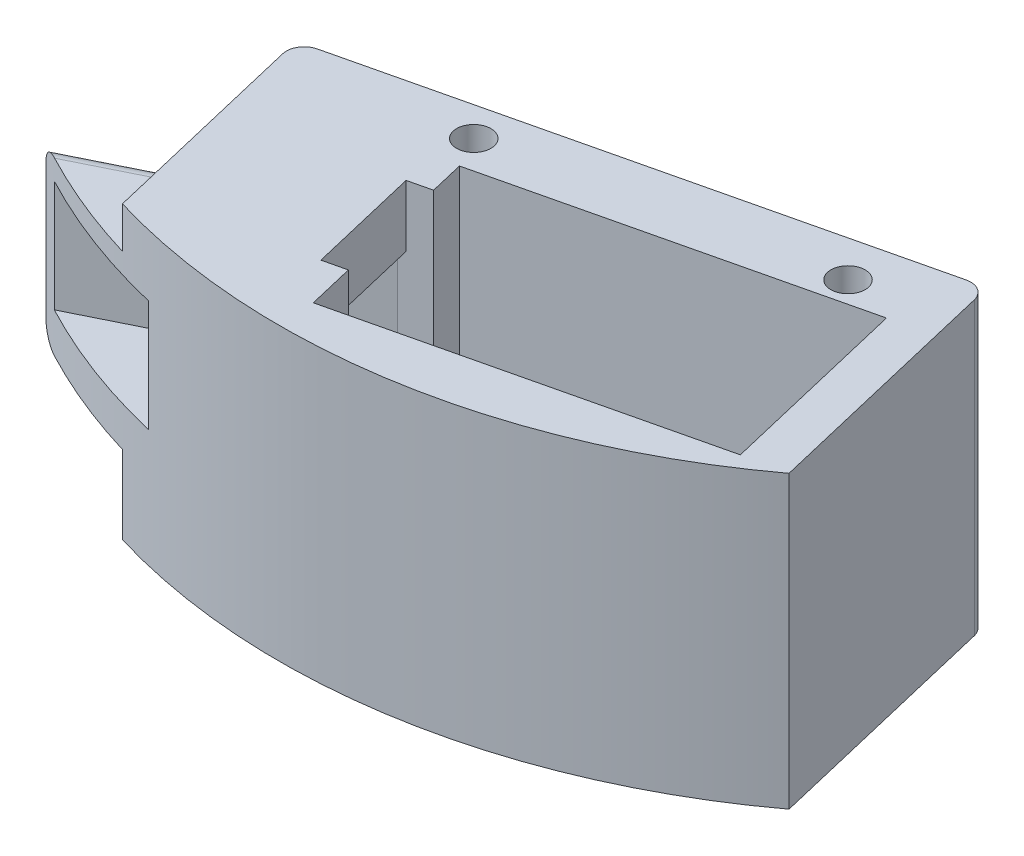
ISO-10303-21;
HEADER;
FILE_DESCRIPTION(('STEP AP214'),'2;1');
FILE_NAME('part.step','',(''),(''),'','','');
FILE_SCHEMA(('AUTOMOTIVE_DESIGN { 1 0 10303 214 1 1 1 1 }'));
ENDSEC;
DATA;
#1=APPLICATION_CONTEXT('core data for automotive mechanical design processes');
#2=APPLICATION_PROTOCOL_DEFINITION('international standard','automotive_design',2000,#1);
#3=PRODUCT_CONTEXT('',#1,'mechanical');
#4=PRODUCT('Part','Part','',(#3));
#5=PRODUCT_RELATED_PRODUCT_CATEGORY('part','',(#4));
#6=PRODUCT_DEFINITION_FORMATION('','',#4);
#7=PRODUCT_DEFINITION_CONTEXT('part definition',#1,'design');
#8=PRODUCT_DEFINITION('design','',#6,#7);
#9=PRODUCT_DEFINITION_SHAPE('','',#8);
#10=(LENGTH_UNIT() NAMED_UNIT(*) SI_UNIT(.MILLI.,.METRE.));
#11=(NAMED_UNIT(*) PLANE_ANGLE_UNIT() SI_UNIT($,.RADIAN.));
#12=(NAMED_UNIT(*) SI_UNIT($,.STERADIAN.) SOLID_ANGLE_UNIT());
#13=UNCERTAINTY_MEASURE_WITH_UNIT(LENGTH_MEASURE(1.E-05),#10,'distance_accuracy_value','');
#14=(GEOMETRIC_REPRESENTATION_CONTEXT(3) GLOBAL_UNCERTAINTY_ASSIGNED_CONTEXT((#13)) GLOBAL_UNIT_ASSIGNED_CONTEXT((#10,
#11,#12)) REPRESENTATION_CONTEXT('',''));
#15=CARTESIAN_POINT('',(0.,0.,0.));
#16=DIRECTION('',(0.,0.,1.));
#17=DIRECTION('',(1.,0.,0.));
#18=AXIS2_PLACEMENT_3D('',#15,#16,#17);
#19=CARTESIAN_POINT('',(-3.67437889319306,3.175,58.3770043475368));
#20=DIRECTION('',(-0.230709787533386,0.,-0.973022607104429));
#21=DIRECTION('',(-0.973022607104429,0.,0.230709787533386));
#22=AXIS2_PLACEMENT_3D('',#19,#20,#21);
#23=PLANE('',#22);
#24=DIRECTION('',(0.,-1.,0.));
#25=VECTOR('',#24,1.);
#26=CARTESIAN_POINT('',(42.5422488990531,3.175,47.418750859276));
#27=LINE('',#26,#25);
#28=CARTESIAN_POINT('',(42.5422488990531,41.656,47.418750859276));
#29=VERTEX_POINT('',#28);
#30=CARTESIAN_POINT('',(42.5422488990531,3.175,47.418750859276));
#31=VERTEX_POINT('',#30);
#32=EDGE_CURVE('E57',#29,#31,#27,.T.);
#33=ORIENTED_EDGE('',*,*,#32,.F.);
#34=DIRECTION('',(-0.973022607104429,0.,0.230709787533386));
#35=VECTOR('',#34,1.);
#36=CARTESIAN_POINT('',(-3.67437889319306,41.656,58.3770043475368));
#37=LINE('',#36,#35);
#38=CARTESIAN_POINT('',(-6.88729954185188,41.656,59.138808065972));
#39=VERTEX_POINT('',#38);
#40=EDGE_CURVE('E305',#29,#39,#37,.T.);
#41=ORIENTED_EDGE('',*,*,#40,.T.);
#42=DIRECTION('',(0.,1.,0.));
#43=VECTOR('',#42,1.);
#44=CARTESIAN_POINT('',(-6.88729954185188,-38.4392891076553,59.138808065972));
#45=LINE('',#44,#43);
#46=CARTESIAN_POINT('',(-6.88729954185188,3.175,59.138808065972));
#47=VERTEX_POINT('',#46);
#48=EDGE_CURVE('E243',#47,#39,#45,.T.);
#49=ORIENTED_EDGE('',*,*,#48,.F.);
#50=DIRECTION('',(-0.973022607104429,0.,0.230709787533386));
#51=VECTOR('',#50,1.);
#52=CARTESIAN_POINT('',(-3.67437889319306,3.175,58.3770043475368));
#53=LINE('',#52,#51);
#54=EDGE_CURVE('E206',#31,#47,#53,.T.);
#55=ORIENTED_EDGE('',*,*,#54,.F.);
#56=EDGE_LOOP('',(#33,#41,#49,#55));
#57=FACE_BOUND('',#56,.T.);
#58=ADVANCED_FACE('F42',(#57),#23,.F.);
#59=CARTESIAN_POINT('',(19.4138663584468,3.175,81.8783245393926));
#60=DIRECTION('',(0.230709787533386,0.,0.973022607104429));
#61=DIRECTION('',(0.973022607104429,0.,-0.230709787533386));
#62=AXIS2_PLACEMENT_3D('',#59,#60,#61);
#63=PLANE('',#62);
#64=DIRECTION('',(0.,1.,0.));
#65=VECTOR('',#64,1.);
#66=CARTESIAN_POINT('',(49.0468806487694,3.175,74.8521502439783));
#67=LINE('',#66,#65);
#68=CARTESIAN_POINT('',(49.0468806487694,3.175,74.8521502439783));
#69=VERTEX_POINT('',#68);
#70=CARTESIAN_POINT('',(49.0468806487694,41.656,74.8521502439783));
#71=VERTEX_POINT('',#70);
#72=EDGE_CURVE('E208',#69,#71,#67,.T.);
#73=ORIENTED_EDGE('',*,*,#72,.F.);
#74=DIRECTION('',(0.973022607104429,0.,-0.230709787533386));
#75=VECTOR('',#74,1.);
#76=CARTESIAN_POINT('',(19.4138663584468,3.175,81.8783245393926));
#77=LINE('',#76,#75);
#78=CARTESIAN_POINT('',(-0.382667792135586,3.175,86.5722074506743));
#79=VERTEX_POINT('',#78);
#80=EDGE_CURVE('E198',#79,#69,#77,.T.);
#81=ORIENTED_EDGE('',*,*,#80,.F.);
#82=DIRECTION('',(0.,1.,0.));
#83=VECTOR('',#82,1.);
#84=CARTESIAN_POINT('',(-0.382667792135586,-38.4392891076553,86.5722074506743));
#85=LINE('',#84,#83);
#86=CARTESIAN_POINT('',(-0.382667792135586,41.656,86.5722074506743));
#87=VERTEX_POINT('',#86);
#88=EDGE_CURVE('E245',#79,#87,#85,.T.);
#89=ORIENTED_EDGE('',*,*,#88,.T.);
#90=DIRECTION('',(0.973022607104429,0.,-0.230709787533386));
#91=VECTOR('',#90,1.);
#92=CARTESIAN_POINT('',(19.4138663584468,41.656,81.8783245393926));
#93=LINE('',#92,#91);
#94=EDGE_CURVE('E65',#87,#71,#93,.T.);
#95=ORIENTED_EDGE('',*,*,#94,.T.);
#96=EDGE_LOOP('',(#73,#81,#89,#95));
#97=FACE_BOUND('',#96,.T.);
#98=ADVANCED_FACE('F209',(#97),#63,.F.);
#99=CARTESIAN_POINT('',(0.,3.175,0.));
#100=DIRECTION('',(0.,-1.,0.));
#101=DIRECTION('',(0.,0.,-1.));
#102=AXIS2_PLACEMENT_3D('',#99,#100,#101);
#103=PLANE('',#102);
#104=DIRECTION('',(0.230709787533386,0.,0.973022607104429));
#105=VECTOR('',#104,1.);
#106=CARTESIAN_POINT('',(42.5422488990531,3.175,47.418750859276));
#107=LINE('',#106,#105);
#108=EDGE_CURVE('E201',#31,#69,#107,.T.);
#109=ORIENTED_EDGE('',*,*,#108,.F.);
#110=ORIENTED_EDGE('',*,*,#54,.T.);
#111=DIRECTION('',(0.230709787533386,0.,0.973022607104429));
#112=VECTOR('',#111,1.);
#113=CARTESIAN_POINT('',(-0.382667792135586,3.175,86.5722074506743));
#114=LINE('',#113,#112);
#115=EDGE_CURVE('E203',#47,#79,#114,.T.);
#116=ORIENTED_EDGE('',*,*,#115,.T.);
#117=ORIENTED_EDGE('',*,*,#80,.T.);
#118=EDGE_LOOP('',(#109,#110,#116,#117));
#119=FACE_BOUND('',#118,.T.);
#120=ADVANCED_FACE('F199',(#119),#103,.F.);
#121=CARTESIAN_POINT('',(-58.8548831658349,11.1983079903898,86.3972126923265));
#122=DIRECTION('',(0.,-1.,0.));
#123=DIRECTION('',(0.,0.,-1.));
#124=AXIS2_PLACEMENT_3D('',#121,#122,#123);
#125=PLANE('',#124);
#126=CARTESIAN_POINT('',(0.,11.1983079903899,0.));
#127=DIRECTION('',(0.,-1.,0.));
#128=DIRECTION('',(0.,0.,-1.));
#129=AXIS2_PLACEMENT_3D('',#126,#127,#128);
#130=CIRCLE('',#129,91.821);
#131=CARTESIAN_POINT('',(-26.3260693042562,11.1983079903898,87.9660964007583));
#132=VERTEX_POINT('',#131);
#133=CARTESIAN_POINT('',(-42.7328338135292,11.1983079903898,81.271156970141));
#134=VERTEX_POINT('',#133);
#135=EDGE_CURVE('E287',#132,#134,#130,.T.);
#136=ORIENTED_EDGE('',*,*,#135,.T.);
#137=DIRECTION('',(0.896692337335021,0.,-0.442654325817175));
#138=VECTOR('',#137,1.);
#139=CARTESIAN_POINT('',(-57.7305411782593,11.1983079903898,88.6748112291575));
#140=LINE('',#139,#138);
#141=CARTESIAN_POINT('',(-29.4663036594652,11.1983079903898,74.7221024987562));
#142=VERTEX_POINT('',#141);
#143=EDGE_CURVE('E455',#134,#142,#140,.T.);
#144=ORIENTED_EDGE('',*,*,#143,.T.);
#145=DIRECTION('',(-0.230709787533386,0.,-0.973022607104429));
#146=VECTOR('',#145,1.);
#147=CARTESIAN_POINT('',(-35.8757033345835,11.1983079903898,47.6903460720575));
#148=LINE('',#147,#146);
#149=EDGE_CURVE('E327',#132,#142,#148,.T.);
#150=ORIENTED_EDGE('',*,*,#149,.F.);
#151=EDGE_LOOP('',(#136,#144,#150));
#152=FACE_BOUND('',#151,.T.);
#153=ADVANCED_FACE('F479',(#152),#125,.T.);
#154=CARTESIAN_POINT('',(-58.8548831658349,35.7665245593911,86.3972126923265));
#155=DIRECTION('',(0.,1.,0.));
#156=DIRECTION('',(0.,0.,1.));
#157=AXIS2_PLACEMENT_3D('',#154,#155,#156);
#158=PLANE('',#157);
#159=DIRECTION('',(0.230709787533386,0.,0.973022607104429));
#160=VECTOR('',#159,1.);
#161=CARTESIAN_POINT('',(-35.8757033345835,35.7665245593911,47.6903460720576));
#162=LINE('',#161,#160);
#163=CARTESIAN_POINT('',(-29.4663036594652,35.7665245593911,74.7221024987562));
#164=VERTEX_POINT('',#163);
#165=CARTESIAN_POINT('',(-26.3260693042562,35.766524559391,87.9660964007583));
#166=VERTEX_POINT('',#165);
#167=EDGE_CURVE('E325',#164,#166,#162,.T.);
#168=ORIENTED_EDGE('',*,*,#167,.F.);
#169=DIRECTION('',(0.896692337335021,0.,-0.442654325817175));
#170=VECTOR('',#169,1.);
#171=CARTESIAN_POINT('',(-57.7305411782593,35.7665245593911,88.6748112291575));
#172=LINE('',#171,#170);
#173=CARTESIAN_POINT('',(-42.7328338135292,35.7665245593911,81.271156970141));
#174=VERTEX_POINT('',#173);
#175=EDGE_CURVE('E355',#164,#174,#172,.F.);
#176=ORIENTED_EDGE('',*,*,#175,.T.);
#177=CARTESIAN_POINT('',(0.,35.7665245593911,0.));
#178=DIRECTION('',(0.,1.,0.));
#179=DIRECTION('',(0.,0.,1.));
#180=AXIS2_PLACEMENT_3D('',#177,#178,#179);
#181=CIRCLE('',#180,91.821);
#182=EDGE_CURVE('E279',#174,#166,#181,.T.);
#183=ORIENTED_EDGE('',*,*,#182,.T.);
#184=EDGE_LOOP('',(#168,#176,#183));
#185=FACE_BOUND('',#184,.T.);
#186=ADVANCED_FACE('F451',(#185),#158,.T.);
#187=CARTESIAN_POINT('',(-58.8548831658349,11.1983079903898,86.3972126923265));
#188=DIRECTION('',(-0.442654325817175,0.,-0.896692337335021));
#189=DIRECTION('',(-0.896692337335021,0.,0.442654325817175));
#190=AXIS2_PLACEMENT_3D('',#187,#188,#189);
#191=PLANE('',#190);
#192=DIRECTION('',(0.,1.,0.));
#193=VECTOR('',#192,1.);
#194=CARTESIAN_POINT('',(-45.4533446539284,-17.573475440609,79.7815110208574));
#195=LINE('',#194,#193);
#196=CARTESIAN_POINT('',(-45.4533446539284,13.7383079903898,79.7815110208575));
#197=VERTEX_POINT('',#196);
#198=CARTESIAN_POINT('',(-45.4533446539284,33.2265245593911,79.7815110208575));
#199=VERTEX_POINT('',#198);
#200=EDGE_CURVE('E330',#197,#199,#195,.T.);
#201=ORIENTED_EDGE('',*,*,#200,.T.);
#202=DIRECTION('',(0.896692337335021,0.,-0.442654325817175));
#203=VECTOR('',#202,1.);
#204=CARTESIAN_POINT('',(-58.8548831658349,33.2265245593911,86.3972126923265));
#205=LINE('',#204,#203);
#206=CARTESIAN_POINT('',(-30.0675625000823,33.2265245593911,72.1862827101954));
#207=VERTEX_POINT('',#206);
#208=EDGE_CURVE('E352',#199,#207,#205,.T.);
#209=ORIENTED_EDGE('',*,*,#208,.T.);
#210=DIRECTION('',(0.,1.,0.));
#211=VECTOR('',#210,1.);
#212=CARTESIAN_POINT('',(-30.0675625000823,41.656,72.1862827101954));
#213=LINE('',#212,#211);
#214=CARTESIAN_POINT('',(-30.0675625000823,13.7383079903898,72.1862827101954));
#215=VERTEX_POINT('',#214);
#216=EDGE_CURVE('E322',#215,#207,#213,.T.);
#217=ORIENTED_EDGE('',*,*,#216,.F.);
#218=DIRECTION('',(0.896692337335021,0.,-0.442654325817175));
#219=VECTOR('',#218,1.);
#220=CARTESIAN_POINT('',(-58.8548831658349,13.7383079903898,86.3972126923265));
#221=LINE('',#220,#219);
#222=EDGE_CURVE('E350',#215,#197,#221,.F.);
#223=ORIENTED_EDGE('',*,*,#222,.T.);
#224=EDGE_LOOP('',(#201,#209,#217,#223));
#225=FACE_BOUND('',#224,.T.);
#226=ADVANCED_FACE('F483',(#225),#191,.T.);
#227=CARTESIAN_POINT('',(-4.58417940961251,16.8850490275809,87.5684123132435));
#228=DIRECTION('',(0.,1.,0.));
#229=DIRECTION('',(0.,0.,1.));
#230=AXIS2_PLACEMENT_3D('',#227,#228,#229);
#231=PLANE('',#230);
#232=DIRECTION('',(0.230709787533386,0.,0.973022607104429));
#233=VECTOR('',#232,1.);
#234=CARTESIAN_POINT('',(-0.382667792135588,16.8850490275809,86.5722074506743));
#235=LINE('',#234,#233);
#236=CARTESIAN_POINT('',(-5.73646934918444,16.8850490275809,63.9924547464005));
#237=VERTEX_POINT('',#236);
#238=CARTESIAN_POINT('',(-1.94485642225671,16.8850490275809,79.9836492888348));
#239=VERTEX_POINT('',#238);
#240=EDGE_CURVE('E251',#237,#239,#235,.T.);
#241=ORIENTED_EDGE('',*,*,#240,.F.);
#242=DIRECTION('',(0.973022607104429,0.,-0.230709787533386));
#243=VECTOR('',#242,1.);
#244=CARTESIAN_POINT('',(-9.93798096666136,16.8850490275809,64.9886596089696));
#245=LINE('',#244,#243);
#246=CARTESIAN_POINT('',(-9.93798096666132,16.8850490275809,64.9886596089698));
#247=VERTEX_POINT('',#246);
#248=EDGE_CURVE('E296',#247,#237,#245,.T.);
#249=ORIENTED_EDGE('',*,*,#248,.F.);
#250=DIRECTION('',(0.896692337335021,0.,-0.442654325817175));
#251=VECTOR('',#250,1.);
#252=CARTESIAN_POINT('',(-57.7675502401114,16.8850490275809,88.5998413480579));
#253=LINE('',#252,#251);
#254=CARTESIAN_POINT('',(-42.8242292912664,16.8850490275809,81.2230350738572));
#255=VERTEX_POINT('',#254);
#256=EDGE_CURVE('E282',#255,#247,#253,.T.);
#257=ORIENTED_EDGE('',*,*,#256,.F.);
#258=CARTESIAN_POINT('',(0.,16.8850490275809,0.));
#259=DIRECTION('',(0.,-1.,0.));
#260=DIRECTION('',(1.,0.,0.));
#261=AXIS2_PLACEMENT_3D('',#258,#259,#260);
#262=CIRCLE('',#261,91.821);
#263=CARTESIAN_POINT('',(-21.1819463575599,16.8850490275809,89.3443965199019));
#264=VERTEX_POINT('',#263);
#265=EDGE_CURVE('E333',#264,#255,#262,.T.);
#266=ORIENTED_EDGE('',*,*,#265,.F.);
#267=DIRECTION('',(0.896692337335021,0.,-0.442654325817175));
#268=VECTOR('',#267,1.);
#269=CARTESIAN_POINT('',(-50.3033302976728,16.8850490275809,103.720237639706));
#270=LINE('',#269,#268);
#271=CARTESIAN_POINT('',(-2.47376102422277,16.8850490275809,80.1090559006176));
#272=VERTEX_POINT('',#271);
#273=EDGE_CURVE('E275',#264,#272,#270,.T.);
#274=ORIENTED_EDGE('',*,*,#273,.T.);
#275=DIRECTION('',(0.973022607104429,0.,-0.230709787533386));
#276=VECTOR('',#275,1.);
#277=CARTESIAN_POINT('',(-6.14636803973363,16.8850490275809,80.979854151404));
#278=LINE('',#277,#276);
#279=EDGE_CURVE('E302',#272,#239,#278,.T.);
#280=ORIENTED_EDGE('',*,*,#279,.T.);
#281=EDGE_LOOP('',(#241,#249,#257,#266,#274,#280));
#282=FACE_BOUND('',#281,.T.);
#283=ADVANCED_FACE('F485',(#282),#231,.T.);
#284=CARTESIAN_POINT('',(-6.14636803973363,3.175,80.979854151404));
#285=DIRECTION('',(-0.230709787533386,0.,-0.973022607104429));
#286=DIRECTION('',(-0.973022607104429,0.,0.230709787533386));
#287=AXIS2_PLACEMENT_3D('',#284,#285,#286);
#288=PLANE('',#287);
#289=DIRECTION('',(0.,1.,0.));
#290=VECTOR('',#289,1.);
#291=CARTESIAN_POINT('',(-1.94485642225671,3.175,79.9836492888348));
#292=LINE('',#291,#290);
#293=CARTESIAN_POINT('',(-1.94485642225671,41.656,79.9836492888348));
#294=VERTEX_POINT('',#293);
#295=EDGE_CURVE('E249',#239,#294,#292,.T.);
#296=ORIENTED_EDGE('',*,*,#295,.F.);
#297=ORIENTED_EDGE('',*,*,#279,.F.);
#298=DIRECTION('',(0.,1.,0.));
#299=VECTOR('',#298,1.);
#300=CARTESIAN_POINT('',(-2.47376102422279,3.175,80.1090559006176));
#301=LINE('',#300,#299);
#302=CARTESIAN_POINT('',(-2.47376102422256,32.8532743935809,80.1090559006175));
#303=VERTEX_POINT('',#302);
#304=EDGE_CURVE('E290',#272,#303,#301,.T.);
#305=ORIENTED_EDGE('',*,*,#304,.T.);
#306=DIRECTION('',(-0.973022607104429,0.,0.230709787533388));
#307=VECTOR('',#306,1.);
#308=CARTESIAN_POINT('',(-1.94485642225671,32.8532743935809,79.9836492888348));
#309=LINE('',#308,#307);
#310=CARTESIAN_POINT('',(-5.13007196474674,32.8532743935809,80.7388839521308));
#311=VERTEX_POINT('',#310);
#312=EDGE_CURVE('E220',#303,#311,#309,.T.);
#313=ORIENTED_EDGE('',*,*,#312,.T.);
#314=DIRECTION('',(0.,-1.,0.));
#315=VECTOR('',#314,1.);
#316=CARTESIAN_POINT('',(-5.13007196474674,41.656,80.7388839521308));
#317=LINE('',#316,#315);
#318=CARTESIAN_POINT('',(-5.13007196474674,41.656,80.7388839521308));
#319=VERTEX_POINT('',#318);
#320=EDGE_CURVE('E231',#319,#311,#317,.T.);
#321=ORIENTED_EDGE('',*,*,#320,.F.);
#322=DIRECTION('',(-0.973022607104429,0.,0.230709787533388));
#323=VECTOR('',#322,1.);
#324=CARTESIAN_POINT('',(-1.94485642225671,41.656,79.9836492888348));
#325=LINE('',#324,#323);
#326=EDGE_CURVE('E224',#294,#319,#325,.T.);
#327=ORIENTED_EDGE('',*,*,#326,.F.);
#328=EDGE_LOOP('',(#296,#297,#305,#313,#321,#327));
#329=FACE_BOUND('',#328,.T.);
#330=ADVANCED_FACE('F491',(#329),#288,.T.);
#331=CARTESIAN_POINT('',(-4.58417940961251,32.8532743935809,87.5684123132435));
#332=DIRECTION('',(0.,-1.,0.));
#333=DIRECTION('',(0.,0.,-1.));
#334=AXIS2_PLACEMENT_3D('',#331,#332,#333);
#335=PLANE('',#334);
#336=DIRECTION('',(-0.230709787533386,0.,-0.973022607104429));
#337=VECTOR('',#336,1.);
#338=CARTESIAN_POINT('',(-8.92168489167447,32.8532743935809,64.7476894096965));
#339=LINE('',#338,#337);
#340=CARTESIAN_POINT('',(-8.92168489167447,32.8532743935809,64.7476894096965));
#341=VERTEX_POINT('',#340);
#342=EDGE_CURVE('E225',#311,#341,#339,.T.);
#343=ORIENTED_EDGE('',*,*,#342,.F.);
#344=ORIENTED_EDGE('',*,*,#312,.F.);
#345=DIRECTION('',(0.896692337335021,0.,-0.442654325817175));
#346=VECTOR('',#345,1.);
#347=CARTESIAN_POINT('',(-50.3033302976729,32.8532743935809,103.720237639706));
#348=LINE('',#347,#346);
#349=CARTESIAN_POINT('',(-21.1819463575599,32.8532743935809,89.3443965199019));
#350=VERTEX_POINT('',#349);
#351=EDGE_CURVE('E276',#350,#303,#348,.T.);
#352=ORIENTED_EDGE('',*,*,#351,.F.);
#353=CARTESIAN_POINT('',(0.,32.8532743935809,0.));
#354=DIRECTION('',(0.,1.,0.));
#355=DIRECTION('',(-1.,0.,0.));
#356=AXIS2_PLACEMENT_3D('',#353,#354,#355);
#357=CIRCLE('',#356,91.821);
#358=CARTESIAN_POINT('',(-42.8242292912665,32.8532743935809,81.2230350738572));
#359=VERTEX_POINT('',#358);
#360=EDGE_CURVE('E339',#359,#350,#357,.T.);
#361=ORIENTED_EDGE('',*,*,#360,.F.);
#362=DIRECTION('',(0.896692337335021,0.,-0.442654325817175));
#363=VECTOR('',#362,1.);
#364=CARTESIAN_POINT('',(-57.7675502401114,32.8532743935809,88.5998413480579));
#365=LINE('',#364,#363);
#366=CARTESIAN_POINT('',(-9.93798096666133,32.8532743935809,64.9886596089698));
#367=VERTEX_POINT('',#366);
#368=EDGE_CURVE('E280',#359,#367,#365,.T.);
#369=ORIENTED_EDGE('',*,*,#368,.T.);
#370=DIRECTION('',(0.973022607104429,0.,-0.230709787533386));
#371=VECTOR('',#370,1.);
#372=CARTESIAN_POINT('',(-9.93798096666136,32.8532743935809,64.9886596089696));
#373=LINE('',#372,#371);
#374=EDGE_CURVE('E299',#367,#341,#373,.T.);
#375=ORIENTED_EDGE('',*,*,#374,.T.);
#376=EDGE_LOOP('',(#343,#344,#352,#361,#369,#375));
#377=FACE_BOUND('',#376,.T.);
#378=ADVANCED_FACE('F379',(#377),#335,.T.);
#379=CARTESIAN_POINT('',(0.,41.656,0.));
#380=DIRECTION('',(0.,-1.,0.));
#381=DIRECTION('',(0.,0.,-1.));
#382=AXIS2_PLACEMENT_3D('',#379,#380,#381);
#383=CYLINDRICAL_SURFACE('',#382,91.821);
#384=ORIENTED_EDGE('',*,*,#360,.T.);
#385=DIRECTION('',(0.,-1.,0.));
#386=VECTOR('',#385,1.);
#387=CARTESIAN_POINT('',(-21.1819463575599,41.6560000000001,89.3443965199019));
#388=LINE('',#387,#386);
#389=EDGE_CURVE('E342',#350,#264,#388,.T.);
#390=ORIENTED_EDGE('',*,*,#389,.T.);
#391=ORIENTED_EDGE('',*,*,#265,.T.);
#392=DIRECTION('',(0.,-1.,0.));
#393=VECTOR('',#392,1.);
#394=CARTESIAN_POINT('',(-42.8242292912665,41.656,81.2230350738572));
#395=LINE('',#394,#393);
#396=EDGE_CURVE('E336',#255,#359,#395,.F.);
#397=ORIENTED_EDGE('',*,*,#396,.T.);
#398=EDGE_LOOP('',(#384,#390,#391,#397));
#399=FACE_BOUND('',#398,.T.);
#400=ORIENTED_EDGE('',*,*,#182,.F.);
#401=CARTESIAN_POINT('',(-42.7328338135292,35.7665245593911,81.271156970141));
#402=CARTESIAN_POINT('',(-42.9231196722472,35.7665062057156,81.1711442903515));
#403=CARTESIAN_POINT('',(-43.1134569019004,35.7486395353107,81.0701715994458));
#404=CARTESIAN_POINT('',(-43.48896132216,35.6760349083314,80.8693396470106));
#405=CARTESIAN_POINT('',(-43.6740922865995,35.6210845098358,80.7694901896362));
#406=CARTESIAN_POINT('',(-43.9969107501188,35.4874588472646,80.5940147771344));
#407=CARTESIAN_POINT('',(-44.1368375277475,35.4154490794683,80.5174457087514));
#408=CARTESIAN_POINT('',(-44.4039063642346,35.2464211651657,80.3704681818967));
#409=CARTESIAN_POINT('',(-44.5310829312484,35.1494732001568,80.3000431657368));
#410=CARTESIAN_POINT('',(-44.7478155019968,34.949390065435,80.1794351017804));
#411=CARTESIAN_POINT('',(-44.840098594757,34.8500584796639,80.1278415708144));
#412=CARTESIAN_POINT('',(-45.0091401264039,34.6351323421691,80.0330102790118));
#413=CARTESIAN_POINT('',(-45.0858948966533,34.5195339582521,79.9897744928377));
#414=CARTESIAN_POINT('',(-45.1867177913468,34.3352934008352,79.9328348992321));
#415=CARTESIAN_POINT('',(-45.2180493960752,34.271760102369,79.915112062622));
#416=CARTESIAN_POINT('',(-45.2753307243687,34.1415898203818,79.8826736491385));
#417=CARTESIAN_POINT('',(-45.3012833488281,34.07495453364,79.8679564513813));
#418=CARTESIAN_POINT('',(-45.3473518949594,33.9391929923799,79.8418087241756));
#419=CARTESIAN_POINT('',(-45.3674769880417,33.8700708466096,79.8303730305313));
#420=CARTESIAN_POINT('',(-45.4015835652521,33.72988546439,79.810980666678));
#421=CARTESIAN_POINT('',(-45.415568879548,33.6588234675513,79.803021827524));
#422=CARTESIAN_POINT('',(-45.4353166696281,33.5275859230139,79.7917799720498));
#423=CARTESIAN_POINT('',(-45.4420708348026,33.4676056895098,79.787933222338));
#424=CARTESIAN_POINT('',(-45.4510874129446,33.3472615880036,79.7827970142569));
#425=CARTESIAN_POINT('',(-45.4533543566146,33.2868981687621,79.781504976422));
#426=CARTESIAN_POINT('',(-45.4533446539285,33.2265245593911,79.7815110208574));
#427=B_SPLINE_CURVE_WITH_KNOTS('',3,(#401,#402,#403,#404,#405,#406,#407,#408,#409,#410,#411,
#412,#413,#414,#415,#416,#417,#418,#419,#420,#421,#422,#423,#424,#425,#426),.UNSPECIFIED.,.F.,
.F.,(4,2,2,2,2,2,2,2,2,2,2,2,4),(0.,0.645003412274439,1.29373358589532,1.81668559318162,
2.33818170109132,2.77169211858531,3.20530483560319,3.42410137125144,3.64277960069836,
3.86111177862538,4.07930756054524,4.26053670869439,4.44158277806226),.UNSPECIFIED.);
#428=EDGE_CURVE('E365',#174,#199,#427,.T.);
#429=ORIENTED_EDGE('',*,*,#428,.T.);
#430=ORIENTED_EDGE('',*,*,#200,.F.);
#431=CARTESIAN_POINT('',(-45.4533446539284,13.7383079903898,79.7815110208574));
#432=CARTESIAN_POINT('',(-45.4533564713884,13.6756999611837,79.781503682908));
#433=CARTESIAN_POINT('',(-45.4509173319105,13.613098927542,79.7828939072838));
#434=CARTESIAN_POINT('',(-45.4412277769308,13.4884163699377,79.7884134180813));
#435=CARTESIAN_POINT('',(-45.4339792943236,13.4263346474081,79.7925416041048));
#436=CARTESIAN_POINT('',(-45.4148095823114,13.3034530149781,79.8034537207177));
#437=CARTESIAN_POINT('',(-45.4029118883547,13.2426482493809,79.8102242747779));
#438=CARTESIAN_POINT('',(-45.3746198757552,13.1224525602185,79.8263125544241));
#439=CARTESIAN_POINT('',(-45.3582253009114,13.0630617174182,79.8356304251384));
#440=CARTESIAN_POINT('',(-45.302641810703,12.887766122674,79.8671929899655));
#441=CARTESIAN_POINT('',(-45.2570110822481,12.774475581337,79.8930706545876));
#442=CARTESIAN_POINT('',(-45.1507077968771,12.5576064973641,79.9531946494246));
#443=CARTESIAN_POINT('',(-45.0900196556292,12.4540381712094,79.9874496496021));
#444=CARTESIAN_POINT('',(-44.9519206385475,12.2523753952984,80.0651453664994));
#445=CARTESIAN_POINT('',(-44.873721480687,12.1549886912015,80.1090157333229));
#446=CARTESIAN_POINT('',(-44.7058346881207,11.9741239995736,80.2028281230073));
#447=CARTESIAN_POINT('',(-44.6161439373642,11.8906497987233,80.2527717925123));
#448=CARTESIAN_POINT('',(-44.4124384893603,11.7256484408279,80.3657077451434));
#449=CARTESIAN_POINT('',(-44.2968379393696,11.6466321797547,80.4295026645677));
#450=CARTESIAN_POINT('',(-44.056705095351,11.5079689933371,80.5612908526151));
#451=CARTESIAN_POINT('',(-43.9321637342292,11.4483420798559,80.6292883731977));
#452=CARTESIAN_POINT('',(-43.6539228302931,11.3391743444357,80.7803218717355));
#453=CARTESIAN_POINT('',(-43.4990187377915,11.2933985485053,80.8638563653805));
#454=CARTESIAN_POINT('',(-43.1847130077093,11.2279321803824,81.0321436309869));
#455=CARTESIAN_POINT('',(-43.0253173088601,11.2082086759023,81.1168947277266));
#456=CARTESIAN_POINT('',(-42.8212248343476,11.1992721326107,81.224634782659));
#457=CARTESIAN_POINT('',(-42.7770311660164,11.19830820979,81.2479183312314));
#458=CARTESIAN_POINT('',(-42.7328338135292,11.1983079903898,81.271156970141));
#459=B_SPLINE_CURVE_WITH_KNOTS('',3,(#431,#432,#433,#434,#435,#436,#437,#438,#439,#440,#441,
#442,#443,#444,#445,#446,#447,#448,#449,#450,#451,#452,#453,#454,#455,#456,#457,#458),
.UNSPECIFIED.,.F.,.F.,(4,2,2,2,2,2,2,2,2,2,2,2,2,4),(0.,0.187749545096273,0.375423678555132,
0.562159816986275,0.748906596549159,1.12160902846972,1.49469882616862,1.89030850942471,
2.28602569380761,2.74591424470813,3.20627595385151,3.74975955165057,4.29255548090178,
4.44239648172494),.UNSPECIFIED.);
#460=EDGE_CURVE('E357',#197,#134,#459,.T.);
#461=ORIENTED_EDGE('',*,*,#460,.T.);
#462=ORIENTED_EDGE('',*,*,#135,.F.);
#463=DIRECTION('',(0.,-1.,0.));
#464=VECTOR('',#463,1.);
#465=CARTESIAN_POINT('',(-26.3260693042562,41.656,87.9660964007583));
#466=LINE('',#465,#464);
#467=CARTESIAN_POINT('',(-26.3260693042562,0.,87.9660964007583));
#468=VERTEX_POINT('',#467);
#469=EDGE_CURVE('E315',#132,#468,#466,.T.);
#470=ORIENTED_EDGE('',*,*,#469,.T.);
#471=CARTESIAN_POINT('',(0.,0.,0.));
#472=DIRECTION('',(0.,1.,0.));
#473=DIRECTION('',(0.,0.,1.));
#474=AXIS2_PLACEMENT_3D('',#471,#472,#473);
#475=CIRCLE('',#474,91.821);
#476=CARTESIAN_POINT('',(54.8250922449754,0.,73.6566718045959));
#477=VERTEX_POINT('',#476);
#478=EDGE_CURVE('E205',#468,#477,#475,.T.);
#479=ORIENTED_EDGE('',*,*,#478,.T.);
#480=DIRECTION('',(0.,-1.,0.));
#481=VECTOR('',#480,1.);
#482=CARTESIAN_POINT('',(54.8250922449754,41.656,73.6566718045959));
#483=LINE('',#482,#481);
#484=CARTESIAN_POINT('',(54.8250922449754,41.656,73.6566718045959));
#485=VERTEX_POINT('',#484);
#486=EDGE_CURVE('E268',#477,#485,#483,.F.);
#487=ORIENTED_EDGE('',*,*,#486,.T.);
#488=CARTESIAN_POINT('',(0.,41.656,0.));
#489=DIRECTION('',(0.,1.,0.));
#490=DIRECTION('',(0.,0.,1.));
#491=AXIS2_PLACEMENT_3D('',#488,#489,#490);
#492=CIRCLE('',#491,91.821);
#493=CARTESIAN_POINT('',(-26.3260693042562,41.656,87.9660964007583));
#494=VERTEX_POINT('',#493);
#495=EDGE_CURVE('E309',#494,#485,#492,.T.);
#496=ORIENTED_EDGE('',*,*,#495,.F.);
#497=EDGE_CURVE('E319',#494,#166,#466,.T.);
#498=ORIENTED_EDGE('',*,*,#497,.T.);
#499=EDGE_LOOP('',(#400,#429,#430,#461,#462,#470,#479,#487,#496,#498));
#500=FACE_BOUND('',#499,.T.);
#501=ADVANCED_FACE('F374',(#399,#500),#383,.T.);
#502=CARTESIAN_POINT('',(-35.8757033345835,41.656,47.6903460720576));
#503=DIRECTION('',(0.973022607104429,0.,-0.230709787533386));
#504=DIRECTION('',(-0.230709787533386,0.,-0.973022607104429));
#505=AXIS2_PLACEMENT_3D('',#502,#503,#504);
#506=PLANE('',#505);
#507=DIRECTION('',(0.230709787533386,0.,0.973022607104429));
#508=VECTOR('',#507,1.);
#509=CARTESIAN_POINT('',(-35.8757033345835,41.656,47.6903460720576));
#510=LINE('',#509,#508);
#511=CARTESIAN_POINT('',(-33.4650571767084,41.656,57.8572888551089));
#512=VERTEX_POINT('',#511);
#513=EDGE_CURVE('E312',#512,#494,#510,.T.);
#514=ORIENTED_EDGE('',*,*,#513,.F.);
#515=DIRECTION('',(0.,-1.,0.));
#516=VECTOR('',#515,1.);
#517=CARTESIAN_POINT('',(-33.4650571767084,41.656,57.8572888551089));
#518=LINE('',#517,#516);
#519=CARTESIAN_POINT('',(-33.4650571767084,0.,57.8572888551089));
#520=VERTEX_POINT('',#519);
#521=EDGE_CURVE('E437',#512,#520,#518,.T.);
#522=ORIENTED_EDGE('',*,*,#521,.T.);
#523=DIRECTION('',(0.230709787533386,0.,0.973022607104429));
#524=VECTOR('',#523,1.);
#525=CARTESIAN_POINT('',(-35.8757033345835,0.,47.6903460720576));
#526=LINE('',#525,#524);
#527=EDGE_CURVE('E313',#520,#468,#526,.T.);
#528=ORIENTED_EDGE('',*,*,#527,.T.);
#529=ORIENTED_EDGE('',*,*,#469,.F.);
#530=ORIENTED_EDGE('',*,*,#149,.T.);
#531=CARTESIAN_POINT('',(-29.4663036594652,13.7383079903898,74.7221024987562));
#532=DIRECTION('',(0.973022607104429,0.,-0.230709787533386));
#533=DIRECTION('',(-0.230709787533386,0.,-0.973022607104429));
#534=AXIS2_PLACEMENT_3D('',#531,#532,#533);
#535=ELLIPSE('',#534,2.60612628118382,2.54);
#536=EDGE_CURVE('E12',#142,#215,#535,.T.);
#537=ORIENTED_EDGE('',*,*,#536,.T.);
#538=ORIENTED_EDGE('',*,*,#216,.T.);
#539=CARTESIAN_POINT('',(-29.4663036594652,33.2265245593911,74.7221024987562));
#540=DIRECTION('',(0.973022607104429,0.,-0.230709787533386));
#541=DIRECTION('',(-0.230709787533386,0.,-0.973022607104429));
#542=AXIS2_PLACEMENT_3D('',#539,#540,#541);
#543=ELLIPSE('',#542,2.60612628118382,2.54);
#544=EDGE_CURVE('E50',#207,#164,#543,.T.);
#545=ORIENTED_EDGE('',*,*,#544,.T.);
#546=ORIENTED_EDGE('',*,*,#167,.T.);
#547=ORIENTED_EDGE('',*,*,#497,.F.);
#548=EDGE_LOOP('',(#514,#522,#528,#529,#530,#537,#538,#545,#546,#547));
#549=FACE_BOUND('',#548,.T.);
#550=ADVANCED_FACE('F378',(#549),#506,.F.);
#551=CARTESIAN_POINT('',(0.,41.656,0.));
#552=DIRECTION('',(0.,1.,0.));
#553=DIRECTION('',(0.,0.,1.));
#554=AXIS2_PLACEMENT_3D('',#551,#552,#553);
#555=PLANE('',#554);
#556=ORIENTED_EDGE('',*,*,#40,.F.);
#557=DIRECTION('',(-0.230709787533386,0.,-0.973022607104429));
#558=VECTOR('',#557,1.);
#559=CARTESIAN_POINT('',(42.5422488990531,41.656,47.418750859276));
#560=LINE('',#559,#558);
#561=EDGE_CURVE('E213',#71,#29,#560,.T.);
#562=ORIENTED_EDGE('',*,*,#561,.F.);
#563=ORIENTED_EDGE('',*,*,#94,.F.);
#564=DIRECTION('',(0.230709787533386,0.,0.973022607104429));
#565=VECTOR('',#564,1.);
#566=CARTESIAN_POINT('',(-0.382667792135586,41.656,86.5722074506743));
#567=LINE('',#566,#565);
#568=EDGE_CURVE('E237',#294,#87,#567,.T.);
#569=ORIENTED_EDGE('',*,*,#568,.F.);
#570=ORIENTED_EDGE('',*,*,#326,.T.);
#571=DIRECTION('',(-0.230709787533386,0.,-0.973022607104429));
#572=VECTOR('',#571,1.);
#573=CARTESIAN_POINT('',(-8.92168489167447,41.656,64.7476894096965));
#574=LINE('',#573,#572);
#575=CARTESIAN_POINT('',(-8.92168489167447,41.656,64.7476894096965));
#576=VERTEX_POINT('',#575);
#577=EDGE_CURVE('E228',#319,#576,#574,.T.);
#578=ORIENTED_EDGE('',*,*,#577,.T.);
#579=DIRECTION('',(0.973022607104429,0.,-0.230709787533388));
#580=VECTOR('',#579,1.);
#581=CARTESIAN_POINT('',(-5.73646934918444,41.656,63.9924547464005));
#582=LINE('',#581,#580);
#583=CARTESIAN_POINT('',(-5.73646934918444,41.656,63.9924547464005));
#584=VERTEX_POINT('',#583);
#585=EDGE_CURVE('E221',#576,#584,#582,.T.);
#586=ORIENTED_EDGE('',*,*,#585,.T.);
#587=EDGE_CURVE('E240',#39,#584,#567,.T.);
#588=ORIENTED_EDGE('',*,*,#587,.F.);
#589=EDGE_LOOP('',(#556,#562,#563,#569,#570,#578,#586,#588));
#590=FACE_BOUND('',#589,.T.);
#591=CARTESIAN_POINT('',(-9.27505177386179,41.656,54.7052056411334));
#592=DIRECTION('',(0.,1.,0.));
#593=DIRECTION('',(0.,0.,1.));
#594=AXIS2_PLACEMENT_3D('',#591,#592,#593);
#595=CIRCLE('',#594,2.45744999999999);
#596=CARTESIAN_POINT('',(-9.27505177386179,41.656,57.1626556411334));
#597=VERTEX_POINT('',#596);
#598=EDGE_CURVE('E253',#597,#597,#595,.T.);
#599=ORIENTED_EDGE('',*,*,#598,.F.);
#600=EDGE_LOOP('',(#599));
#601=FACE_BOUND('',#600,.T.);
#602=CARTESIAN_POINT('',(35.0431177026747,41.656,45.4285242840644));
#603=DIRECTION('',(0.,1.,0.));
#604=DIRECTION('',(0.,0.,1.));
#605=AXIS2_PLACEMENT_3D('',#602,#603,#604);
#606=CIRCLE('',#605,2.45744999999999);
#607=CARTESIAN_POINT('',(35.0431177026747,41.656,47.8859742840644));
#608=VERTEX_POINT('',#607);
#609=EDGE_CURVE('E259',#608,#608,#606,.T.);
#610=ORIENTED_EDGE('',*,*,#609,.F.);
#611=EDGE_LOOP('',(#610));
#612=FACE_BOUND('',#611,.T.);
#613=DIRECTION('',(0.230709787533385,0.,0.973022607104429));
#614=VECTOR('',#613,1.);
#615=CARTESIAN_POINT('',(56.9195928755967,41.656,82.4902652380522));
#616=LINE('',#615,#614);
#617=CARTESIAN_POINT('',(46.5789341900307,41.656,38.8783544431949));
#618=VERTEX_POINT('',#617);
#619=EDGE_CURVE('E269',#618,#485,#616,.T.);
#620=ORIENTED_EDGE('',*,*,#619,.F.);
#621=CARTESIAN_POINT('',(44.1074567679855,41.656,39.4643573035297));
#622=DIRECTION('',(0.,1.,0.));
#623=DIRECTION('',(0.,0.,1.));
#624=AXIS2_PLACEMENT_3D('',#621,#622,#623);
#625=CIRCLE('',#624,2.54);
#626=CARTESIAN_POINT('',(43.5214539076507,41.656,36.9928798814845));
#627=VERTEX_POINT('',#626);
#628=EDGE_CURVE('E464',#618,#627,#625,.T.);
#629=ORIENTED_EDGE('',*,*,#628,.T.);
#630=DIRECTION('',(0.973022607104429,0.,-0.230709787533385));
#631=VECTOR('',#630,1.);
#632=CARTESIAN_POINT('',(45.9929313296959,41.656,36.4068770211497));
#633=LINE('',#632,#631);
#634=CARTESIAN_POINT('',(-31.579582614998,41.656,54.7998085727288));
#635=VERTEX_POINT('',#634);
#636=EDGE_CURVE('E265',#635,#627,#633,.T.);
#637=ORIENTED_EDGE('',*,*,#636,.F.);
#638=CARTESIAN_POINT('',(-30.9935797546632,41.656,57.2712859947741));
#639=DIRECTION('',(0.,1.,0.));
#640=DIRECTION('',(0.,0.,1.));
#641=AXIS2_PLACEMENT_3D('',#638,#639,#640);
#642=CIRCLE('',#641,2.54);
#643=EDGE_CURVE('E460',#635,#512,#642,.T.);
#644=ORIENTED_EDGE('',*,*,#643,.T.);
#645=ORIENTED_EDGE('',*,*,#513,.T.);
#646=ORIENTED_EDGE('',*,*,#495,.T.);
#647=EDGE_LOOP('',(#620,#629,#637,#644,#645,#646));
#648=FACE_BOUND('',#647,.T.);
#649=ADVANCED_FACE('F406',(#590,#601,#612,#648),#555,.T.);
#650=CARTESIAN_POINT('',(0.,0.,0.));
#651=DIRECTION('',(0.,1.,0.));
#652=DIRECTION('',(0.,0.,1.));
#653=AXIS2_PLACEMENT_3D('',#650,#651,#652);
#654=PLANE('',#653);
#655=CARTESIAN_POINT('',(-9.27505177386179,0.,54.7052056411334));
#656=DIRECTION('',(0.,1.,0.));
#657=DIRECTION('',(0.,0.,1.));
#658=AXIS2_PLACEMENT_3D('',#655,#656,#657);
#659=CIRCLE('',#658,2.45744999999999);
#660=CARTESIAN_POINT('',(-9.27505177386179,0.,57.1626556411334));
#661=VERTEX_POINT('',#660);
#662=EDGE_CURVE('E256',#661,#661,#659,.T.);
#663=ORIENTED_EDGE('',*,*,#662,.T.);
#664=EDGE_LOOP('',(#663));
#665=FACE_BOUND('',#664,.T.);
#666=CARTESIAN_POINT('',(35.0431177026747,0.,45.4285242840644));
#667=DIRECTION('',(0.,1.,0.));
#668=DIRECTION('',(0.,0.,1.));
#669=AXIS2_PLACEMENT_3D('',#666,#667,#668);
#670=CIRCLE('',#669,2.45744999999999);
#671=CARTESIAN_POINT('',(35.0431177026747,0.,47.8859742840644));
#672=VERTEX_POINT('',#671);
#673=EDGE_CURVE('E262',#672,#672,#670,.T.);
#674=ORIENTED_EDGE('',*,*,#673,.T.);
#675=EDGE_LOOP('',(#674));
#676=FACE_BOUND('',#675,.T.);
#677=DIRECTION('',(0.973022607104429,0.,-0.230709787533385));
#678=VECTOR('',#677,1.);
#679=CARTESIAN_POINT('',(10.6208943664241,0.,44.7938097325123));
#680=LINE('',#679,#678);
#681=CARTESIAN_POINT('',(-31.579582614998,0.,54.7998085727288));
#682=VERTEX_POINT('',#681);
#683=CARTESIAN_POINT('',(43.5214539076507,0.,36.9928798814845));
#684=VERTEX_POINT('',#683);
#685=EDGE_CURVE('E345',#682,#684,#680,.T.);
#686=ORIENTED_EDGE('',*,*,#685,.T.);
#687=CARTESIAN_POINT('',(44.1074567679855,0.,39.4643573035297));
#688=DIRECTION('',(0.,1.,0.));
#689=DIRECTION('',(0.,0.,1.));
#690=AXIS2_PLACEMENT_3D('',#687,#688,#689);
#691=CIRCLE('',#690,2.54);
#692=CARTESIAN_POINT('',(46.5789341900307,0.,38.8783544431949));
#693=VERTEX_POINT('',#692);
#694=EDGE_CURVE('E425',#684,#693,#691,.F.);
#695=ORIENTED_EDGE('',*,*,#694,.T.);
#696=DIRECTION('',(0.230709787533385,0.,0.973022607104429));
#697=VECTOR('',#696,1.);
#698=CARTESIAN_POINT('',(56.9195928755967,0.,82.4902652380522));
#699=LINE('',#698,#697);
#700=EDGE_CURVE('E266',#693,#477,#699,.T.);
#701=ORIENTED_EDGE('',*,*,#700,.T.);
#702=ORIENTED_EDGE('',*,*,#478,.F.);
#703=ORIENTED_EDGE('',*,*,#527,.F.);
#704=CARTESIAN_POINT('',(-30.9935797546632,0.,57.2712859947741));
#705=DIRECTION('',(0.,1.,0.));
#706=DIRECTION('',(0.,0.,1.));
#707=AXIS2_PLACEMENT_3D('',#704,#705,#706);
#708=CIRCLE('',#707,2.54);
#709=EDGE_CURVE('E428',#520,#682,#708,.F.);
#710=ORIENTED_EDGE('',*,*,#709,.T.);
#711=EDGE_LOOP('',(#686,#695,#701,#702,#703,#710));
#712=FACE_BOUND('',#711,.T.);
#713=ADVANCED_FACE('F408',(#665,#676,#712),#654,.F.);
#714=CARTESIAN_POINT('',(-9.93798096666136,3.17500000000001,64.9886596089696));
#715=DIRECTION('',(0.230709787533386,0.,0.973022607104429));
#716=DIRECTION('',(0.973022607104429,0.,-0.230709787533386));
#717=AXIS2_PLACEMENT_3D('',#714,#715,#716);
#718=PLANE('',#717);
#719=DIRECTION('',(0.,-1.,0.));
#720=VECTOR('',#719,1.);
#721=CARTESIAN_POINT('',(-5.73646934918444,3.17500000000001,63.9924547464005));
#722=LINE('',#721,#720);
#723=EDGE_CURVE('E348',#584,#237,#722,.T.);
#724=ORIENTED_EDGE('',*,*,#723,.F.);
#725=ORIENTED_EDGE('',*,*,#585,.F.);
#726=DIRECTION('',(0.,-1.,0.));
#727=VECTOR('',#726,1.);
#728=CARTESIAN_POINT('',(-8.92168489167447,41.656,64.7476894096965));
#729=LINE('',#728,#727);
#730=EDGE_CURVE('E235',#576,#341,#729,.T.);
#731=ORIENTED_EDGE('',*,*,#730,.T.);
#732=ORIENTED_EDGE('',*,*,#374,.F.);
#733=DIRECTION('',(0.,-1.,0.));
#734=VECTOR('',#733,1.);
#735=CARTESIAN_POINT('',(-9.93798096666136,3.17500000000001,64.9886596089696));
#736=LINE('',#735,#734);
#737=EDGE_CURVE('E293',#367,#247,#736,.T.);
#738=ORIENTED_EDGE('',*,*,#737,.T.);
#739=ORIENTED_EDGE('',*,*,#248,.T.);
#740=EDGE_LOOP('',(#724,#725,#731,#732,#738,#739));
#741=FACE_BOUND('',#740,.T.);
#742=ADVANCED_FACE('F411',(#741),#718,.T.);
#743=CARTESIAN_POINT('',(-50.3033302976728,16.8850490275809,103.720237639706));
#744=DIRECTION('',(0.442654325817175,0.,0.896692337335021));
#745=DIRECTION('',(0.896692337335021,0.,-0.442654325817175));
#746=AXIS2_PLACEMENT_3D('',#743,#744,#745);
#747=PLANE('',#746);
#748=ORIENTED_EDGE('',*,*,#351,.T.);
#749=ORIENTED_EDGE('',*,*,#304,.F.);
#750=ORIENTED_EDGE('',*,*,#273,.F.);
#751=ORIENTED_EDGE('',*,*,#389,.F.);
#752=EDGE_LOOP('',(#748,#749,#750,#751));
#753=FACE_BOUND('',#752,.T.);
#754=ADVANCED_FACE('F416',(#753),#747,.F.);
#755=CARTESIAN_POINT('',(-57.7675502401114,16.8850490275809,88.5998413480579));
#756=DIRECTION('',(-0.442654325817175,0.,-0.896692337335021));
#757=DIRECTION('',(-0.896692337335021,0.,0.442654325817175));
#758=AXIS2_PLACEMENT_3D('',#755,#756,#757);
#759=PLANE('',#758);
#760=ORIENTED_EDGE('',*,*,#256,.T.);
#761=ORIENTED_EDGE('',*,*,#737,.F.);
#762=ORIENTED_EDGE('',*,*,#368,.F.);
#763=ORIENTED_EDGE('',*,*,#396,.F.);
#764=EDGE_LOOP('',(#760,#761,#762,#763));
#765=FACE_BOUND('',#764,.T.);
#766=ADVANCED_FACE('F555',(#765),#759,.F.);
#767=CARTESIAN_POINT('',(45.9929313296959,0.,36.4068770211497));
#768=DIRECTION('',(0.230709787533385,0.,0.973022607104429));
#769=DIRECTION('',(0.973022607104429,0.,-0.230709787533385));
#770=AXIS2_PLACEMENT_3D('',#767,#768,#769);
#771=PLANE('',#770);
#772=ORIENTED_EDGE('',*,*,#636,.T.);
#773=DIRECTION('',(0.,1.,0.));
#774=VECTOR('',#773,1.);
#775=CARTESIAN_POINT('',(43.5214539076507,0.,36.9928798814845));
#776=LINE('',#775,#774);
#777=EDGE_CURVE('E434',#627,#684,#776,.F.);
#778=ORIENTED_EDGE('',*,*,#777,.T.);
#779=ORIENTED_EDGE('',*,*,#685,.F.);
#780=DIRECTION('',(0.,-1.,0.));
#781=VECTOR('',#780,1.);
#782=CARTESIAN_POINT('',(-31.579582614998,0.,54.7998085727288));
#783=LINE('',#782,#781);
#784=EDGE_CURVE('E466',#682,#635,#783,.F.);
#785=ORIENTED_EDGE('',*,*,#784,.T.);
#786=EDGE_LOOP('',(#772,#778,#779,#785));
#787=FACE_BOUND('',#786,.T.);
#788=ADVANCED_FACE('F467',(#787),#771,.F.);
#789=CARTESIAN_POINT('',(56.9195928755967,0.,82.4902652380522));
#790=DIRECTION('',(-0.973022607104429,0.,0.230709787533385));
#791=DIRECTION('',(0.230709787533385,0.,0.973022607104429));
#792=AXIS2_PLACEMENT_3D('',#789,#790,#791);
#793=PLANE('',#792);
#794=ORIENTED_EDGE('',*,*,#700,.F.);
#795=DIRECTION('',(0.,1.,0.));
#796=VECTOR('',#795,1.);
#797=CARTESIAN_POINT('',(46.5789341900307,0.,38.8783544431949));
#798=LINE('',#797,#796);
#799=EDGE_CURVE('E436',#693,#618,#798,.T.);
#800=ORIENTED_EDGE('',*,*,#799,.T.);
#801=ORIENTED_EDGE('',*,*,#619,.T.);
#802=ORIENTED_EDGE('',*,*,#486,.F.);
#803=EDGE_LOOP('',(#794,#800,#801,#802));
#804=FACE_BOUND('',#803,.T.);
#805=ADVANCED_FACE('F554',(#804),#793,.F.);
#806=CARTESIAN_POINT('',(35.0431177026747,41.656,45.4285242840644));
#807=DIRECTION('',(0.,1.,0.));
#808=DIRECTION('',(0.,0.,1.));
#809=AXIS2_PLACEMENT_3D('',#806,#807,#808);
#810=CYLINDRICAL_SURFACE('',#809,2.45744999999999);
#811=ORIENTED_EDGE('',*,*,#673,.F.);
#812=EDGE_LOOP('',(#811));
#813=FACE_BOUND('',#812,.T.);
#814=ORIENTED_EDGE('',*,*,#609,.T.);
#815=EDGE_LOOP('',(#814));
#816=FACE_BOUND('',#815,.T.);
#817=ADVANCED_FACE('F565',(#813,#816),#810,.F.);
#818=CARTESIAN_POINT('',(-9.27505177386179,41.656,54.7052056411334));
#819=DIRECTION('',(0.,1.,0.));
#820=DIRECTION('',(0.,0.,1.));
#821=AXIS2_PLACEMENT_3D('',#818,#819,#820);
#822=CYLINDRICAL_SURFACE('',#821,2.45744999999999);
#823=ORIENTED_EDGE('',*,*,#662,.F.);
#824=EDGE_LOOP('',(#823));
#825=FACE_BOUND('',#824,.T.);
#826=ORIENTED_EDGE('',*,*,#598,.T.);
#827=EDGE_LOOP('',(#826));
#828=FACE_BOUND('',#827,.T.);
#829=ADVANCED_FACE('F637',(#825,#828),#822,.F.);
#830=CARTESIAN_POINT('',(-0.382667792135586,-38.4392891076553,86.5722074506743));
#831=DIRECTION('',(-0.973022607104429,0.,0.230709787533386));
#832=DIRECTION('',(0.230709787533386,0.,0.973022607104429));
#833=AXIS2_PLACEMENT_3D('',#830,#831,#832);
#834=PLANE('',#833);
#835=ORIENTED_EDGE('',*,*,#587,.T.);
#836=ORIENTED_EDGE('',*,*,#723,.T.);
#837=ORIENTED_EDGE('',*,*,#240,.T.);
#838=ORIENTED_EDGE('',*,*,#295,.T.);
#839=ORIENTED_EDGE('',*,*,#568,.T.);
#840=ORIENTED_EDGE('',*,*,#88,.F.);
#841=ORIENTED_EDGE('',*,*,#115,.F.);
#842=ORIENTED_EDGE('',*,*,#48,.T.);
#843=EDGE_LOOP('',(#835,#836,#837,#838,#839,#840,#841,#842));
#844=FACE_BOUND('',#843,.T.);
#845=ADVANCED_FACE('F394',(#844),#834,.F.);
#846=CARTESIAN_POINT('',(-8.92168489167447,41.656,64.7476894096965));
#847=DIRECTION('',(-0.973022607104429,0.,0.230709787533386));
#848=DIRECTION('',(0.230709787533386,0.,0.973022607104429));
#849=AXIS2_PLACEMENT_3D('',#846,#847,#848);
#850=PLANE('',#849);
#851=ORIENTED_EDGE('',*,*,#342,.T.);
#852=ORIENTED_EDGE('',*,*,#730,.F.);
#853=ORIENTED_EDGE('',*,*,#577,.F.);
#854=ORIENTED_EDGE('',*,*,#320,.T.);
#855=EDGE_LOOP('',(#851,#852,#853,#854));
#856=FACE_BOUND('',#855,.T.);
#857=ADVANCED_FACE('F386',(#856),#850,.F.);
#858=CARTESIAN_POINT('',(-57.7305411782593,33.2265245593911,88.6748112291575));
#859=DIRECTION('',(0.896692337335021,0.,-0.442654325817175));
#860=DIRECTION('',(-0.442654325817175,0.,-0.896692337335021));
#861=AXIS2_PLACEMENT_3D('',#858,#859,#860);
#862=CYLINDRICAL_SURFACE('',#861,2.54);
#863=ORIENTED_EDGE('',*,*,#428,.F.);
#864=ORIENTED_EDGE('',*,*,#175,.F.);
#865=ORIENTED_EDGE('',*,*,#544,.F.);
#866=ORIENTED_EDGE('',*,*,#208,.F.);
#867=EDGE_LOOP('',(#863,#864,#865,#866));
#868=FACE_BOUND('',#867,.T.);
#869=ADVANCED_FACE('F382',(#868),#862,.T.);
#870=CARTESIAN_POINT('',(-57.7305411782593,13.7383079903898,88.6748112291575));
#871=DIRECTION('',(0.896692337335021,0.,-0.442654325817175));
#872=DIRECTION('',(-0.442654325817175,0.,-0.896692337335021));
#873=AXIS2_PLACEMENT_3D('',#870,#871,#872);
#874=CYLINDRICAL_SURFACE('',#873,2.54);
#875=ORIENTED_EDGE('',*,*,#460,.F.);
#876=ORIENTED_EDGE('',*,*,#222,.F.);
#877=ORIENTED_EDGE('',*,*,#536,.F.);
#878=ORIENTED_EDGE('',*,*,#143,.F.);
#879=EDGE_LOOP('',(#875,#876,#877,#878));
#880=FACE_BOUND('',#879,.T.);
#881=ADVANCED_FACE('F372',(#880),#874,.T.);
#882=CARTESIAN_POINT('',(44.1074567679855,0.,39.4643573035297));
#883=DIRECTION('',(0.,1.,0.));
#884=DIRECTION('',(0.,0.,1.));
#885=AXIS2_PLACEMENT_3D('',#882,#883,#884);
#886=CYLINDRICAL_SURFACE('',#885,2.54);
#887=ORIENTED_EDGE('',*,*,#694,.F.);
#888=ORIENTED_EDGE('',*,*,#777,.F.);
#889=ORIENTED_EDGE('',*,*,#628,.F.);
#890=ORIENTED_EDGE('',*,*,#799,.F.);
#891=EDGE_LOOP('',(#887,#888,#889,#890));
#892=FACE_BOUND('',#891,.T.);
#893=ADVANCED_FACE('F392',(#892),#886,.T.);
#894=CARTESIAN_POINT('',(-30.9935797546632,41.656,57.2712859947741));
#895=DIRECTION('',(0.,-1.,0.));
#896=DIRECTION('',(0.,0.,-1.));
#897=AXIS2_PLACEMENT_3D('',#894,#895,#896);
#898=CYLINDRICAL_SURFACE('',#897,2.54);
#899=ORIENTED_EDGE('',*,*,#643,.F.);
#900=ORIENTED_EDGE('',*,*,#784,.F.);
#901=ORIENTED_EDGE('',*,*,#709,.F.);
#902=ORIENTED_EDGE('',*,*,#521,.F.);
#903=EDGE_LOOP('',(#899,#900,#901,#902));
#904=FACE_BOUND('',#903,.T.);
#905=ADVANCED_FACE('F44',(#904),#898,.T.);
#906=CARTESIAN_POINT('',(29.6330142903226,0.,-7.02617429541427));
#907=DIRECTION('',(0.973022607104429,0.,-0.230709787533386));
#908=DIRECTION('',(-0.230709787533386,0.,-0.973022607104429));
#909=AXIS2_PLACEMENT_3D('',#906,#907,#908);
#910=PLANE('',#909);
#911=ORIENTED_EDGE('',*,*,#32,.T.);
#912=ORIENTED_EDGE('',*,*,#108,.T.);
#913=ORIENTED_EDGE('',*,*,#72,.T.);
#914=ORIENTED_EDGE('',*,*,#561,.T.);
#915=EDGE_LOOP('',(#911,#912,#913,#914));
#916=FACE_BOUND('',#915,.T.);
#917=ADVANCED_FACE('F215',(#916),#910,.F.);
#918=CLOSED_SHELL('',(#58,#98,#120,#153,#186,#226,#283,#330,#378,#501,#550,#649,#713,#742,#754,
#766,#788,#805,#817,#829,#845,#857,#869,#881,#893,#905,#917));
#919=MANIFOLD_SOLID_BREP('B2',#918);
#920=ADVANCED_BREP_SHAPE_REPRESENTATION('',(#18,#919),#14);
#921=SHAPE_DEFINITION_REPRESENTATION(#9,#920);
ENDSEC;
END-ISO-10303-21;
